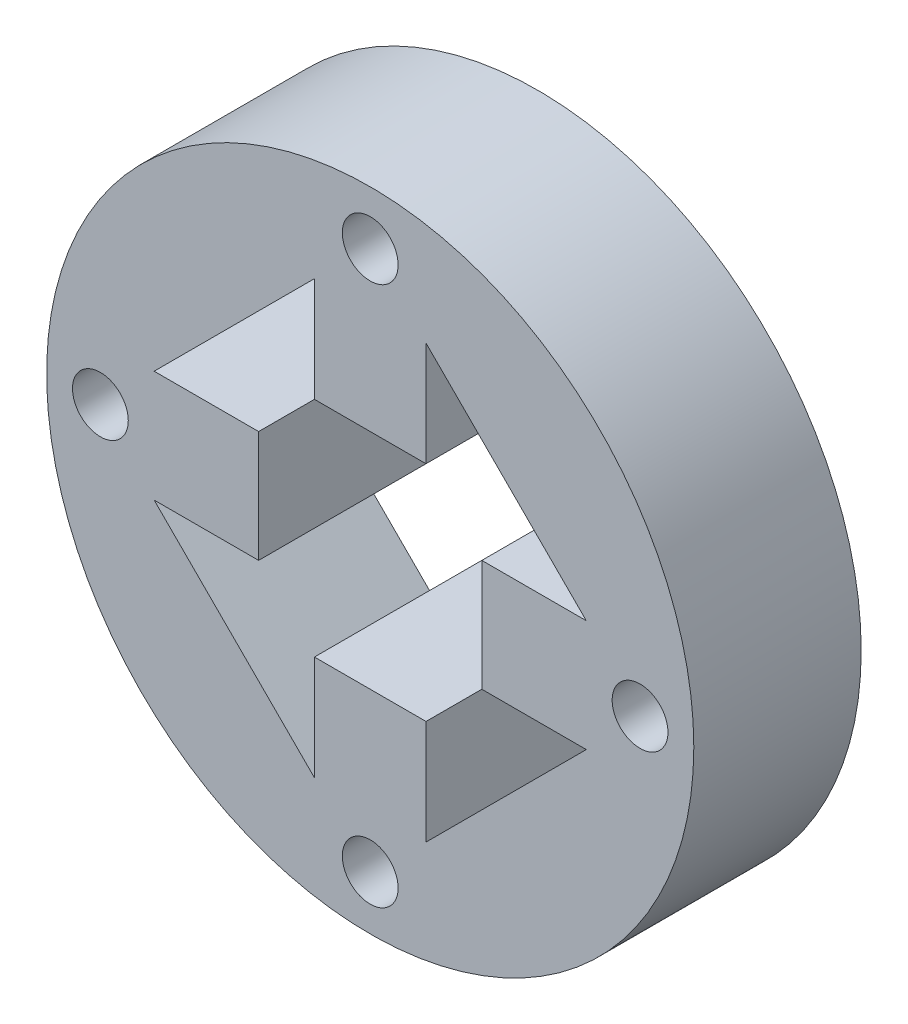
ISO-10303-21;
HEADER;
FILE_DESCRIPTION(('STEP AP214'),'2;1');
FILE_NAME('part.step','',(''),(''),'','','');
FILE_SCHEMA(('AUTOMOTIVE_DESIGN { 1 0 10303 214 1 1 1 1 }'));
ENDSEC;
DATA;
#1=APPLICATION_CONTEXT('core data for automotive mechanical design processes');
#2=APPLICATION_PROTOCOL_DEFINITION('international standard','automotive_design',2000,#1);
#3=PRODUCT_CONTEXT('',#1,'mechanical');
#4=PRODUCT('Part','Part','',(#3));
#5=PRODUCT_RELATED_PRODUCT_CATEGORY('part','',(#4));
#6=PRODUCT_DEFINITION_FORMATION('','',#4);
#7=PRODUCT_DEFINITION_CONTEXT('part definition',#1,'design');
#8=PRODUCT_DEFINITION('design','',#6,#7);
#9=PRODUCT_DEFINITION_SHAPE('','',#8);
#10=(LENGTH_UNIT() NAMED_UNIT(*) SI_UNIT(.MILLI.,.METRE.));
#11=(NAMED_UNIT(*) PLANE_ANGLE_UNIT() SI_UNIT($,.RADIAN.));
#12=(NAMED_UNIT(*) SI_UNIT($,.STERADIAN.) SOLID_ANGLE_UNIT());
#13=UNCERTAINTY_MEASURE_WITH_UNIT(LENGTH_MEASURE(1.E-05),#10,'distance_accuracy_value','');
#14=(GEOMETRIC_REPRESENTATION_CONTEXT(3) GLOBAL_UNCERTAINTY_ASSIGNED_CONTEXT((#13)) GLOBAL_UNIT_ASSIGNED_CONTEXT((#10,
#11,#12)) REPRESENTATION_CONTEXT('',''));
#15=CARTESIAN_POINT('',(0.,0.,0.));
#16=DIRECTION('',(0.,0.,1.));
#17=DIRECTION('',(1.,0.,0.));
#18=AXIS2_PLACEMENT_3D('',#15,#16,#17);
#19=CARTESIAN_POINT('',(0.,0.,-15.));
#20=DIRECTION('',(0.,0.,1.));
#21=DIRECTION('',(1.,0.,0.));
#22=AXIS2_PLACEMENT_3D('',#19,#20,#21);
#23=CYLINDRICAL_SURFACE('',#22,29.);
#24=CARTESIAN_POINT('',(0.,0.,-15.));
#25=DIRECTION('',(0.,0.,1.));
#26=DIRECTION('',(1.,0.,0.));
#27=AXIS2_PLACEMENT_3D('',#24,#25,#26);
#28=CIRCLE('',#27,29.);
#29=CARTESIAN_POINT('',(29.,0.,-15.));
#30=VERTEX_POINT('',#29);
#31=EDGE_CURVE('E11',#30,#30,#28,.T.);
#32=ORIENTED_EDGE('',*,*,#31,.T.);
#33=EDGE_LOOP('',(#32));
#34=FACE_BOUND('',#33,.T.);
#35=CARTESIAN_POINT('',(0.,0.,0.));
#36=DIRECTION('',(0.,0.,1.));
#37=DIRECTION('',(1.,0.,0.));
#38=AXIS2_PLACEMENT_3D('',#35,#36,#37);
#39=CIRCLE('',#38,29.);
#40=CARTESIAN_POINT('',(29.,0.,0.));
#41=VERTEX_POINT('',#40);
#42=EDGE_CURVE('E44',#41,#41,#39,.T.);
#43=ORIENTED_EDGE('',*,*,#42,.F.);
#44=EDGE_LOOP('',(#43));
#45=FACE_BOUND('',#44,.T.);
#46=ADVANCED_FACE('F36',(#34,#45),#23,.T.);
#47=CARTESIAN_POINT('',(0.,0.,-15.));
#48=DIRECTION('',(0.,0.,1.));
#49=DIRECTION('',(1.,0.,0.));
#50=AXIS2_PLACEMENT_3D('',#47,#48,#49);
#51=PLANE('',#50);
#52=CARTESIAN_POINT('',(0.,24.1824583655185,-15.));
#53=DIRECTION('',(0.,0.,1.));
#54=DIRECTION('',(1.,0.,0.));
#55=AXIS2_PLACEMENT_3D('',#52,#53,#54);
#56=CIRCLE('',#55,2.5);
#57=CARTESIAN_POINT('',(2.5,24.1824583655185,-15.));
#58=VERTEX_POINT('',#57);
#59=EDGE_CURVE('E205',#58,#58,#56,.F.);
#60=ORIENTED_EDGE('',*,*,#59,.F.);
#61=EDGE_LOOP('',(#60));
#62=FACE_BOUND('',#61,.T.);
#63=CARTESIAN_POINT('',(24.1824583655185,0.,-15.));
#64=DIRECTION('',(0.,0.,1.));
#65=DIRECTION('',(1.,0.,0.));
#66=AXIS2_PLACEMENT_3D('',#63,#64,#65);
#67=CIRCLE('',#66,2.5);
#68=CARTESIAN_POINT('',(26.6824583655185,0.,-15.));
#69=VERTEX_POINT('',#68);
#70=EDGE_CURVE('E202',#69,#69,#67,.F.);
#71=ORIENTED_EDGE('',*,*,#70,.F.);
#72=EDGE_LOOP('',(#71));
#73=FACE_BOUND('',#72,.T.);
#74=CARTESIAN_POINT('',(0.,-24.1824583655185,-15.));
#75=DIRECTION('',(0.,0.,1.));
#76=DIRECTION('',(1.,0.,0.));
#77=AXIS2_PLACEMENT_3D('',#74,#75,#76);
#78=CIRCLE('',#77,2.5);
#79=CARTESIAN_POINT('',(2.5,-24.1824583655185,-15.));
#80=VERTEX_POINT('',#79);
#81=EDGE_CURVE('E198',#80,#80,#78,.F.);
#82=ORIENTED_EDGE('',*,*,#81,.F.);
#83=EDGE_LOOP('',(#82));
#84=FACE_BOUND('',#83,.T.);
#85=CARTESIAN_POINT('',(-24.1824583655185,0.,-15.));
#86=DIRECTION('',(0.,0.,1.));
#87=DIRECTION('',(1.,0.,0.));
#88=AXIS2_PLACEMENT_3D('',#85,#86,#87);
#89=CIRCLE('',#88,2.5);
#90=CARTESIAN_POINT('',(-21.6824583655186,0.,-15.));
#91=VERTEX_POINT('',#90);
#92=EDGE_CURVE('E194',#91,#91,#89,.F.);
#93=ORIENTED_EDGE('',*,*,#92,.F.);
#94=EDGE_LOOP('',(#93));
#95=FACE_BOUND('',#94,.T.);
#96=DIRECTION('',(-1.,0.,0.));
#97=VECTOR('',#96,1.);
#98=CARTESIAN_POINT('',(0.,5.00000000000002,-15.));
#99=LINE('',#98,#97);
#100=CARTESIAN_POINT('',(19.3649167310371,5.,-15.));
#101=VERTEX_POINT('',#100);
#102=CARTESIAN_POINT('',(9.99999673103709,5.00000000000001,-15.));
#103=VERTEX_POINT('',#102);
#104=EDGE_CURVE('E276',#101,#103,#99,.T.);
#105=ORIENTED_EDGE('',*,*,#104,.F.);
#106=DIRECTION('',(-0.707106781186548,0.707106781186548,0.));
#107=VECTOR('',#106,1.);
#108=CARTESIAN_POINT('',(19.3649167310371,5.,-15.));
#109=LINE('',#108,#107);
#110=CARTESIAN_POINT('',(5.,19.3649167310371,-15.));
#111=VERTEX_POINT('',#110);
#112=EDGE_CURVE('E186',#101,#111,#109,.T.);
#113=ORIENTED_EDGE('',*,*,#112,.T.);
#114=DIRECTION('',(0.,-1.,0.));
#115=VECTOR('',#114,1.);
#116=CARTESIAN_POINT('',(4.99999999999994,0.,-15.));
#117=LINE('',#116,#115);
#118=CARTESIAN_POINT('',(4.99999999999997,9.99999673103708,-15.));
#119=VERTEX_POINT('',#118);
#120=EDGE_CURVE('E249',#111,#119,#117,.T.);
#121=ORIENTED_EDGE('',*,*,#120,.T.);
#122=DIRECTION('',(1.,0.,0.));
#123=VECTOR('',#122,1.);
#124=CARTESIAN_POINT('',(0.,9.99999673103708,-15.));
#125=LINE('',#124,#123);
#126=CARTESIAN_POINT('',(-5.,9.99999673103708,-15.));
#127=VERTEX_POINT('',#126);
#128=EDGE_CURVE('E255',#127,#119,#125,.T.);
#129=ORIENTED_EDGE('',*,*,#128,.F.);
#130=DIRECTION('',(0.,-1.,0.));
#131=VECTOR('',#130,1.);
#132=CARTESIAN_POINT('',(-5.,0.,-15.));
#133=LINE('',#132,#131);
#134=CARTESIAN_POINT('',(-5.,19.3649167310371,-15.));
#135=VERTEX_POINT('',#134);
#136=EDGE_CURVE('E251',#135,#127,#133,.T.);
#137=ORIENTED_EDGE('',*,*,#136,.F.);
#138=DIRECTION('',(-0.707106781186548,-0.707106781186547,0.));
#139=VECTOR('',#138,1.);
#140=CARTESIAN_POINT('',(-5.,19.3649167310371,-15.));
#141=LINE('',#140,#139);
#142=CARTESIAN_POINT('',(-19.3649167310371,5.,-15.));
#143=VERTEX_POINT('',#142);
#144=EDGE_CURVE('E182',#135,#143,#141,.T.);
#145=ORIENTED_EDGE('',*,*,#144,.T.);
#146=DIRECTION('',(1.,0.,0.));
#147=VECTOR('',#146,1.);
#148=CARTESIAN_POINT('',(0.,5.00000000000001,-15.));
#149=LINE('',#148,#147);
#150=CARTESIAN_POINT('',(-9.99999673103708,5.,-15.));
#151=VERTEX_POINT('',#150);
#152=EDGE_CURVE('E230',#143,#151,#149,.T.);
#153=ORIENTED_EDGE('',*,*,#152,.T.);
#154=DIRECTION('',(0.,-1.,0.));
#155=VECTOR('',#154,1.);
#156=CARTESIAN_POINT('',(-9.99999673103708,0.,-15.));
#157=LINE('',#156,#155);
#158=CARTESIAN_POINT('',(-9.99999673103708,-5.,-15.));
#159=VERTEX_POINT('',#158);
#160=EDGE_CURVE('E227',#151,#159,#157,.T.);
#161=ORIENTED_EDGE('',*,*,#160,.T.);
#162=DIRECTION('',(1.,0.,0.));
#163=VECTOR('',#162,1.);
#164=CARTESIAN_POINT('',(0.,-5.,-15.));
#165=LINE('',#164,#163);
#166=CARTESIAN_POINT('',(-19.3649167310371,-5.,-15.));
#167=VERTEX_POINT('',#166);
#168=EDGE_CURVE('E224',#167,#159,#165,.T.);
#169=ORIENTED_EDGE('',*,*,#168,.F.);
#170=DIRECTION('',(0.707106781186548,-0.707106781186548,0.));
#171=VECTOR('',#170,1.);
#172=CARTESIAN_POINT('',(-19.3649167310371,-5.,-15.));
#173=LINE('',#172,#171);
#174=CARTESIAN_POINT('',(-5.,-19.3649167310371,-15.));
#175=VERTEX_POINT('',#174);
#176=EDGE_CURVE('E176',#167,#175,#173,.T.);
#177=ORIENTED_EDGE('',*,*,#176,.T.);
#178=DIRECTION('',(0.,1.,0.));
#179=VECTOR('',#178,1.);
#180=CARTESIAN_POINT('',(-5.,0.,-15.));
#181=LINE('',#180,#179);
#182=CARTESIAN_POINT('',(-5.,-9.99999673103708,-15.));
#183=VERTEX_POINT('',#182);
#184=EDGE_CURVE('E208',#175,#183,#181,.T.);
#185=ORIENTED_EDGE('',*,*,#184,.T.);
#186=DIRECTION('',(1.,0.,0.));
#187=VECTOR('',#186,1.);
#188=CARTESIAN_POINT('',(0.,-9.99999673103708,-15.));
#189=LINE('',#188,#187);
#190=CARTESIAN_POINT('',(5.,-9.99999673103708,-15.));
#191=VERTEX_POINT('',#190);
#192=EDGE_CURVE('E213',#183,#191,#189,.T.);
#193=ORIENTED_EDGE('',*,*,#192,.T.);
#194=DIRECTION('',(0.,1.,0.));
#195=VECTOR('',#194,1.);
#196=CARTESIAN_POINT('',(4.99999999999999,0.,-15.));
#197=LINE('',#196,#195);
#198=CARTESIAN_POINT('',(5.,-19.3649167310371,-15.));
#199=VERTEX_POINT('',#198);
#200=EDGE_CURVE('E211',#199,#191,#197,.T.);
#201=ORIENTED_EDGE('',*,*,#200,.F.);
#202=DIRECTION('',(0.707106781186548,0.707106781186547,0.));
#203=VECTOR('',#202,1.);
#204=CARTESIAN_POINT('',(5.,-19.3649167310371,-15.));
#205=LINE('',#204,#203);
#206=CARTESIAN_POINT('',(19.3649167310371,-5.,-15.));
#207=VERTEX_POINT('',#206);
#208=EDGE_CURVE('E166',#199,#207,#205,.T.);
#209=ORIENTED_EDGE('',*,*,#208,.T.);
#210=DIRECTION('',(-1.,0.,0.));
#211=VECTOR('',#210,1.);
#212=CARTESIAN_POINT('',(0.,-5.00000000000002,-15.));
#213=LINE('',#212,#211);
#214=CARTESIAN_POINT('',(9.99999673103709,-5.00000000000001,-15.));
#215=VERTEX_POINT('',#214);
#216=EDGE_CURVE('E274',#207,#215,#213,.T.);
#217=ORIENTED_EDGE('',*,*,#216,.T.);
#218=DIRECTION('',(0.,-1.,0.));
#219=VECTOR('',#218,1.);
#220=CARTESIAN_POINT('',(9.99999673103709,0.,-15.));
#221=LINE('',#220,#219);
#222=EDGE_CURVE('E280',#103,#215,#221,.T.);
#223=ORIENTED_EDGE('',*,*,#222,.F.);
#224=EDGE_LOOP('',(#105,#113,#121,#129,#137,#145,#153,#161,#169,#177,#185,#193,#201,#209,#217,#223));
#225=FACE_BOUND('',#224,.T.);
#226=ORIENTED_EDGE('',*,*,#31,.F.);
#227=EDGE_LOOP('',(#226));
#228=FACE_BOUND('',#227,.T.);
#229=ADVANCED_FACE('F314',(#62,#73,#84,#95,#225,#228),#51,.F.);
#230=CARTESIAN_POINT('',(0.,0.,0.));
#231=DIRECTION('',(0.,0.,1.));
#232=DIRECTION('',(1.,0.,0.));
#233=AXIS2_PLACEMENT_3D('',#230,#231,#232);
#234=PLANE('',#233);
#235=CARTESIAN_POINT('',(0.,24.1824583655185,0.));
#236=DIRECTION('',(0.,0.,1.));
#237=DIRECTION('',(1.,0.,0.));
#238=AXIS2_PLACEMENT_3D('',#235,#236,#237);
#239=CIRCLE('',#238,2.5);
#240=CARTESIAN_POINT('',(2.5,24.1824583655185,0.));
#241=VERTEX_POINT('',#240);
#242=EDGE_CURVE('E39',#241,#241,#239,.F.);
#243=ORIENTED_EDGE('',*,*,#242,.T.);
#244=EDGE_LOOP('',(#243));
#245=FACE_BOUND('',#244,.T.);
#246=CARTESIAN_POINT('',(24.1824583655185,0.,0.));
#247=DIRECTION('',(0.,0.,1.));
#248=DIRECTION('',(1.,0.,0.));
#249=AXIS2_PLACEMENT_3D('',#246,#247,#248);
#250=CIRCLE('',#249,2.5);
#251=CARTESIAN_POINT('',(26.6824583655185,0.,0.));
#252=VERTEX_POINT('',#251);
#253=EDGE_CURVE('E201',#252,#252,#250,.F.);
#254=ORIENTED_EDGE('',*,*,#253,.T.);
#255=EDGE_LOOP('',(#254));
#256=FACE_BOUND('',#255,.T.);
#257=CARTESIAN_POINT('',(0.,-24.1824583655185,0.));
#258=DIRECTION('',(0.,0.,1.));
#259=DIRECTION('',(1.,0.,0.));
#260=AXIS2_PLACEMENT_3D('',#257,#258,#259);
#261=CIRCLE('',#260,2.5);
#262=CARTESIAN_POINT('',(2.5,-24.1824583655185,0.));
#263=VERTEX_POINT('',#262);
#264=EDGE_CURVE('E197',#263,#263,#261,.F.);
#265=ORIENTED_EDGE('',*,*,#264,.T.);
#266=EDGE_LOOP('',(#265));
#267=FACE_BOUND('',#266,.T.);
#268=CARTESIAN_POINT('',(-24.1824583655185,0.,0.));
#269=DIRECTION('',(0.,0.,1.));
#270=DIRECTION('',(1.,0.,0.));
#271=AXIS2_PLACEMENT_3D('',#268,#269,#270);
#272=CIRCLE('',#271,2.5);
#273=CARTESIAN_POINT('',(-21.6824583655186,0.,0.));
#274=VERTEX_POINT('',#273);
#275=EDGE_CURVE('E191',#274,#274,#272,.F.);
#276=ORIENTED_EDGE('',*,*,#275,.T.);
#277=EDGE_LOOP('',(#276));
#278=FACE_BOUND('',#277,.T.);
#279=DIRECTION('',(0.,-1.,0.));
#280=VECTOR('',#279,1.);
#281=CARTESIAN_POINT('',(4.99999999999994,0.,0.));
#282=LINE('',#281,#280);
#283=CARTESIAN_POINT('',(5.,19.3649167310371,0.));
#284=VERTEX_POINT('',#283);
#285=CARTESIAN_POINT('',(4.99999999999997,9.99999673103708,0.));
#286=VERTEX_POINT('',#285);
#287=EDGE_CURVE('E242',#284,#286,#282,.T.);
#288=ORIENTED_EDGE('',*,*,#287,.F.);
#289=DIRECTION('',(-0.707106781186548,0.707106781186548,0.));
#290=VECTOR('',#289,1.);
#291=CARTESIAN_POINT('',(19.3649167310371,5.,0.));
#292=LINE('',#291,#290);
#293=CARTESIAN_POINT('',(19.3649167310371,5.,0.));
#294=VERTEX_POINT('',#293);
#295=EDGE_CURVE('E189',#294,#284,#292,.T.);
#296=ORIENTED_EDGE('',*,*,#295,.F.);
#297=DIRECTION('',(-1.,0.,0.));
#298=VECTOR('',#297,1.);
#299=CARTESIAN_POINT('',(0.,5.00000000000002,0.));
#300=LINE('',#299,#298);
#301=CARTESIAN_POINT('',(9.99999673103709,5.00000000000001,0.));
#302=VERTEX_POINT('',#301);
#303=EDGE_CURVE('E285',#294,#302,#300,.T.);
#304=ORIENTED_EDGE('',*,*,#303,.T.);
#305=DIRECTION('',(0.,-1.,0.));
#306=VECTOR('',#305,1.);
#307=CARTESIAN_POINT('',(9.99999673103709,0.,0.));
#308=LINE('',#307,#306);
#309=CARTESIAN_POINT('',(9.99999673103709,-5.00000000000001,0.));
#310=VERTEX_POINT('',#309);
#311=EDGE_CURVE('E277',#302,#310,#308,.T.);
#312=ORIENTED_EDGE('',*,*,#311,.T.);
#313=DIRECTION('',(-1.,0.,0.));
#314=VECTOR('',#313,1.);
#315=CARTESIAN_POINT('',(0.,-5.00000000000002,0.));
#316=LINE('',#315,#314);
#317=CARTESIAN_POINT('',(19.3649167310371,-5.,0.));
#318=VERTEX_POINT('',#317);
#319=EDGE_CURVE('E175',#318,#310,#316,.T.);
#320=ORIENTED_EDGE('',*,*,#319,.F.);
#321=DIRECTION('',(0.707106781186548,0.707106781186547,0.));
#322=VECTOR('',#321,1.);
#323=CARTESIAN_POINT('',(5.,-19.3649167310371,0.));
#324=LINE('',#323,#322);
#325=CARTESIAN_POINT('',(5.,-19.3649167310371,0.));
#326=VERTEX_POINT('',#325);
#327=EDGE_CURVE('E164',#326,#318,#324,.T.);
#328=ORIENTED_EDGE('',*,*,#327,.F.);
#329=DIRECTION('',(0.,1.,0.));
#330=VECTOR('',#329,1.);
#331=CARTESIAN_POINT('',(4.99999999999999,0.,0.));
#332=LINE('',#331,#330);
#333=CARTESIAN_POINT('',(5.,-9.99999673103708,0.));
#334=VERTEX_POINT('',#333);
#335=EDGE_CURVE('E149',#326,#334,#332,.T.);
#336=ORIENTED_EDGE('',*,*,#335,.T.);
#337=DIRECTION('',(1.,0.,0.));
#338=VECTOR('',#337,1.);
#339=CARTESIAN_POINT('',(0.,-9.99999673103708,0.));
#340=LINE('',#339,#338);
#341=CARTESIAN_POINT('',(-5.,-9.99999673103708,0.));
#342=VERTEX_POINT('',#341);
#343=EDGE_CURVE('E156',#342,#334,#340,.T.);
#344=ORIENTED_EDGE('',*,*,#343,.F.);
#345=DIRECTION('',(0.,1.,0.));
#346=VECTOR('',#345,1.);
#347=CARTESIAN_POINT('',(-5.,0.,0.));
#348=LINE('',#347,#346);
#349=CARTESIAN_POINT('',(-5.,-19.3649167310371,0.));
#350=VERTEX_POINT('',#349);
#351=EDGE_CURVE('E157',#350,#342,#348,.T.);
#352=ORIENTED_EDGE('',*,*,#351,.F.);
#353=DIRECTION('',(0.707106781186548,-0.707106781186548,0.));
#354=VECTOR('',#353,1.);
#355=CARTESIAN_POINT('',(-19.3649167310371,-5.,0.));
#356=LINE('',#355,#354);
#357=CARTESIAN_POINT('',(-19.3649167310371,-5.,0.));
#358=VERTEX_POINT('',#357);
#359=EDGE_CURVE('E60',#358,#350,#356,.T.);
#360=ORIENTED_EDGE('',*,*,#359,.F.);
#361=DIRECTION('',(1.,0.,0.));
#362=VECTOR('',#361,1.);
#363=CARTESIAN_POINT('',(0.,-5.,0.));
#364=LINE('',#363,#362);
#365=CARTESIAN_POINT('',(-9.99999673103708,-5.,0.));
#366=VERTEX_POINT('',#365);
#367=EDGE_CURVE('E221',#358,#366,#364,.T.);
#368=ORIENTED_EDGE('',*,*,#367,.T.);
#369=DIRECTION('',(0.,-1.,0.));
#370=VECTOR('',#369,1.);
#371=CARTESIAN_POINT('',(-9.99999673103708,0.,0.));
#372=LINE('',#371,#370);
#373=CARTESIAN_POINT('',(-9.99999673103708,5.,0.));
#374=VERTEX_POINT('',#373);
#375=EDGE_CURVE('E235',#374,#366,#372,.T.);
#376=ORIENTED_EDGE('',*,*,#375,.F.);
#377=DIRECTION('',(1.,0.,0.));
#378=VECTOR('',#377,1.);
#379=CARTESIAN_POINT('',(0.,5.00000000000001,0.));
#380=LINE('',#379,#378);
#381=CARTESIAN_POINT('',(-19.3649167310371,5.,0.));
#382=VERTEX_POINT('',#381);
#383=EDGE_CURVE('E228',#382,#374,#380,.T.);
#384=ORIENTED_EDGE('',*,*,#383,.F.);
#385=DIRECTION('',(-0.707106781186548,-0.707106781186547,0.));
#386=VECTOR('',#385,1.);
#387=CARTESIAN_POINT('',(-5.,19.3649167310371,0.));
#388=LINE('',#387,#386);
#389=CARTESIAN_POINT('',(-5.,19.3649167310371,0.));
#390=VERTEX_POINT('',#389);
#391=EDGE_CURVE('E184',#390,#382,#388,.T.);
#392=ORIENTED_EDGE('',*,*,#391,.F.);
#393=DIRECTION('',(0.,-1.,0.));
#394=VECTOR('',#393,1.);
#395=CARTESIAN_POINT('',(-5.,0.,0.));
#396=LINE('',#395,#394);
#397=CARTESIAN_POINT('',(-5.,9.99999673103708,0.));
#398=VERTEX_POINT('',#397);
#399=EDGE_CURVE('E261',#390,#398,#396,.T.);
#400=ORIENTED_EDGE('',*,*,#399,.T.);
#401=DIRECTION('',(1.,0.,0.));
#402=VECTOR('',#401,1.);
#403=CARTESIAN_POINT('',(0.,9.99999673103708,0.));
#404=LINE('',#403,#402);
#405=EDGE_CURVE('E252',#398,#286,#404,.T.);
#406=ORIENTED_EDGE('',*,*,#405,.T.);
#407=EDGE_LOOP('',(#288,#296,#304,#312,#320,#328,#336,#344,#352,#360,#368,#376,#384,#392,#400,#406));
#408=FACE_BOUND('',#407,.T.);
#409=ORIENTED_EDGE('',*,*,#42,.T.);
#410=EDGE_LOOP('',(#409));
#411=FACE_BOUND('',#410,.T.);
#412=ADVANCED_FACE('F171',(#245,#256,#267,#278,#408,#411),#234,.T.);
#413=CARTESIAN_POINT('',(0.,-5.00000000000002,-15.));
#414=DIRECTION('',(0.,1.,0.));
#415=DIRECTION('',(-1.,0.,0.));
#416=AXIS2_PLACEMENT_3D('',#413,#414,#415);
#417=PLANE('',#416);
#418=ORIENTED_EDGE('',*,*,#319,.T.);
#419=DIRECTION('',(0.,0.,1.));
#420=VECTOR('',#419,1.);
#421=CARTESIAN_POINT('',(9.99999673103709,-5.00000000000001,-15.));
#422=LINE('',#421,#420);
#423=EDGE_CURVE('E289',#215,#310,#422,.T.);
#424=ORIENTED_EDGE('',*,*,#423,.F.);
#425=ORIENTED_EDGE('',*,*,#216,.F.);
#426=DIRECTION('',(0.,0.,1.));
#427=VECTOR('',#426,1.);
#428=CARTESIAN_POINT('',(19.3649167310371,-5.,-15.));
#429=LINE('',#428,#427);
#430=EDGE_CURVE('E283',#207,#318,#429,.T.);
#431=ORIENTED_EDGE('',*,*,#430,.T.);
#432=EDGE_LOOP('',(#418,#424,#425,#431));
#433=FACE_BOUND('',#432,.T.);
#434=ADVANCED_FACE('F332',(#433),#417,.F.);
#435=CARTESIAN_POINT('',(9.99999673103709,0.,-15.));
#436=DIRECTION('',(-1.,0.,0.));
#437=DIRECTION('',(0.,-1.,0.));
#438=AXIS2_PLACEMENT_3D('',#435,#436,#437);
#439=PLANE('',#438);
#440=ORIENTED_EDGE('',*,*,#311,.F.);
#441=DIRECTION('',(0.,0.,1.));
#442=VECTOR('',#441,1.);
#443=CARTESIAN_POINT('',(9.99999673103709,5.00000000000001,-15.));
#444=LINE('',#443,#442);
#445=EDGE_CURVE('E291',#103,#302,#444,.T.);
#446=ORIENTED_EDGE('',*,*,#445,.F.);
#447=ORIENTED_EDGE('',*,*,#222,.T.);
#448=ORIENTED_EDGE('',*,*,#423,.T.);
#449=EDGE_LOOP('',(#440,#446,#447,#448));
#450=FACE_BOUND('',#449,.T.);
#451=ADVANCED_FACE('F337',(#450),#439,.T.);
#452=CARTESIAN_POINT('',(0.,5.00000000000002,-15.));
#453=DIRECTION('',(0.,1.,0.));
#454=DIRECTION('',(-1.,0.,0.));
#455=AXIS2_PLACEMENT_3D('',#452,#453,#454);
#456=PLANE('',#455);
#457=ORIENTED_EDGE('',*,*,#303,.F.);
#458=DIRECTION('',(0.,0.,1.));
#459=VECTOR('',#458,1.);
#460=CARTESIAN_POINT('',(19.3649167310371,5.,-15.));
#461=LINE('',#460,#459);
#462=EDGE_CURVE('E293',#101,#294,#461,.T.);
#463=ORIENTED_EDGE('',*,*,#462,.F.);
#464=ORIENTED_EDGE('',*,*,#104,.T.);
#465=ORIENTED_EDGE('',*,*,#445,.T.);
#466=EDGE_LOOP('',(#457,#463,#464,#465));
#467=FACE_BOUND('',#466,.T.);
#468=ADVANCED_FACE('F342',(#467),#456,.T.);
#469=CARTESIAN_POINT('',(4.99999999999994,0.,-15.));
#470=DIRECTION('',(-1.,0.,0.));
#471=DIRECTION('',(0.,-1.,0.));
#472=AXIS2_PLACEMENT_3D('',#469,#470,#471);
#473=PLANE('',#472);
#474=ORIENTED_EDGE('',*,*,#287,.T.);
#475=DIRECTION('',(0.,0.,1.));
#476=VECTOR('',#475,1.);
#477=CARTESIAN_POINT('',(4.99999999999997,9.99999673103708,-15.));
#478=LINE('',#477,#476);
#479=EDGE_CURVE('E266',#119,#286,#478,.T.);
#480=ORIENTED_EDGE('',*,*,#479,.F.);
#481=ORIENTED_EDGE('',*,*,#120,.F.);
#482=DIRECTION('',(0.,0.,1.));
#483=VECTOR('',#482,1.);
#484=CARTESIAN_POINT('',(5.,19.3649167310371,-15.));
#485=LINE('',#484,#483);
#486=EDGE_CURVE('E258',#111,#284,#485,.T.);
#487=ORIENTED_EDGE('',*,*,#486,.T.);
#488=EDGE_LOOP('',(#474,#480,#481,#487));
#489=FACE_BOUND('',#488,.T.);
#490=ADVANCED_FACE('F345',(#489),#473,.F.);
#491=CARTESIAN_POINT('',(0.,9.99999673103708,-15.));
#492=DIRECTION('',(0.,-1.,0.));
#493=DIRECTION('',(0.,0.,-1.));
#494=AXIS2_PLACEMENT_3D('',#491,#492,#493);
#495=PLANE('',#494);
#496=ORIENTED_EDGE('',*,*,#405,.F.);
#497=DIRECTION('',(0.,0.,1.));
#498=VECTOR('',#497,1.);
#499=CARTESIAN_POINT('',(-5.,9.99999673103708,-15.));
#500=LINE('',#499,#498);
#501=EDGE_CURVE('E268',#127,#398,#500,.T.);
#502=ORIENTED_EDGE('',*,*,#501,.F.);
#503=ORIENTED_EDGE('',*,*,#128,.T.);
#504=ORIENTED_EDGE('',*,*,#479,.T.);
#505=EDGE_LOOP('',(#496,#502,#503,#504));
#506=FACE_BOUND('',#505,.T.);
#507=ADVANCED_FACE('F352',(#506),#495,.T.);
#508=CARTESIAN_POINT('',(-5.,0.,-15.));
#509=DIRECTION('',(-1.,0.,0.));
#510=DIRECTION('',(0.,-1.,0.));
#511=AXIS2_PLACEMENT_3D('',#508,#509,#510);
#512=PLANE('',#511);
#513=ORIENTED_EDGE('',*,*,#399,.F.);
#514=DIRECTION('',(0.,0.,1.));
#515=VECTOR('',#514,1.);
#516=CARTESIAN_POINT('',(-5.,19.3649167310371,-15.));
#517=LINE('',#516,#515);
#518=EDGE_CURVE('E270',#135,#390,#517,.T.);
#519=ORIENTED_EDGE('',*,*,#518,.F.);
#520=ORIENTED_EDGE('',*,*,#136,.T.);
#521=ORIENTED_EDGE('',*,*,#501,.T.);
#522=EDGE_LOOP('',(#513,#519,#520,#521));
#523=FACE_BOUND('',#522,.T.);
#524=ADVANCED_FACE('F354',(#523),#512,.T.);
#525=CARTESIAN_POINT('',(0.,5.00000000000001,-15.));
#526=DIRECTION('',(0.,-1.,0.));
#527=DIRECTION('',(1.,0.,0.));
#528=AXIS2_PLACEMENT_3D('',#525,#526,#527);
#529=PLANE('',#528);
#530=ORIENTED_EDGE('',*,*,#383,.T.);
#531=DIRECTION('',(0.,0.,1.));
#532=VECTOR('',#531,1.);
#533=CARTESIAN_POINT('',(-9.99999673103708,5.,-15.));
#534=LINE('',#533,#532);
#535=EDGE_CURVE('E243',#151,#374,#534,.T.);
#536=ORIENTED_EDGE('',*,*,#535,.F.);
#537=ORIENTED_EDGE('',*,*,#152,.F.);
#538=DIRECTION('',(0.,0.,1.));
#539=VECTOR('',#538,1.);
#540=CARTESIAN_POINT('',(-19.3649167310371,5.,-15.));
#541=LINE('',#540,#539);
#542=EDGE_CURVE('E239',#143,#382,#541,.T.);
#543=ORIENTED_EDGE('',*,*,#542,.T.);
#544=EDGE_LOOP('',(#530,#536,#537,#543));
#545=FACE_BOUND('',#544,.T.);
#546=ADVANCED_FACE('F357',(#545),#529,.F.);
#547=CARTESIAN_POINT('',(-9.99999673103708,0.,-15.));
#548=DIRECTION('',(-1.,0.,0.));
#549=DIRECTION('',(0.,-1.,0.));
#550=AXIS2_PLACEMENT_3D('',#547,#548,#549);
#551=PLANE('',#550);
#552=ORIENTED_EDGE('',*,*,#375,.T.);
#553=DIRECTION('',(0.,0.,1.));
#554=VECTOR('',#553,1.);
#555=CARTESIAN_POINT('',(-9.99999673103708,-5.,-15.));
#556=LINE('',#555,#554);
#557=EDGE_CURVE('E246',#159,#366,#556,.T.);
#558=ORIENTED_EDGE('',*,*,#557,.F.);
#559=ORIENTED_EDGE('',*,*,#160,.F.);
#560=ORIENTED_EDGE('',*,*,#535,.T.);
#561=EDGE_LOOP('',(#552,#558,#559,#560));
#562=FACE_BOUND('',#561,.T.);
#563=ADVANCED_FACE('F366',(#562),#551,.F.);
#564=CARTESIAN_POINT('',(0.,-5.,-15.));
#565=DIRECTION('',(0.,-1.,0.));
#566=DIRECTION('',(1.,0.,0.));
#567=AXIS2_PLACEMENT_3D('',#564,#565,#566);
#568=PLANE('',#567);
#569=ORIENTED_EDGE('',*,*,#367,.F.);
#570=DIRECTION('',(0.,0.,1.));
#571=VECTOR('',#570,1.);
#572=CARTESIAN_POINT('',(-19.3649167310371,-5.,-15.));
#573=LINE('',#572,#571);
#574=EDGE_CURVE('E232',#167,#358,#573,.T.);
#575=ORIENTED_EDGE('',*,*,#574,.F.);
#576=ORIENTED_EDGE('',*,*,#168,.T.);
#577=ORIENTED_EDGE('',*,*,#557,.T.);
#578=EDGE_LOOP('',(#569,#575,#576,#577));
#579=FACE_BOUND('',#578,.T.);
#580=ADVANCED_FACE('F362',(#579),#568,.T.);
#581=CARTESIAN_POINT('',(-5.,0.,-15.));
#582=DIRECTION('',(1.,0.,0.));
#583=DIRECTION('',(0.,1.,0.));
#584=AXIS2_PLACEMENT_3D('',#581,#582,#583);
#585=PLANE('',#584);
#586=ORIENTED_EDGE('',*,*,#351,.T.);
#587=DIRECTION('',(0.,0.,1.));
#588=VECTOR('',#587,1.);
#589=CARTESIAN_POINT('',(-5.,-9.99999673103708,-15.));
#590=LINE('',#589,#588);
#591=EDGE_CURVE('E218',#183,#342,#590,.T.);
#592=ORIENTED_EDGE('',*,*,#591,.F.);
#593=ORIENTED_EDGE('',*,*,#184,.F.);
#594=DIRECTION('',(0.,0.,1.));
#595=VECTOR('',#594,1.);
#596=CARTESIAN_POINT('',(-5.,-19.3649167310371,-15.));
#597=LINE('',#596,#595);
#598=EDGE_CURVE('E167',#175,#350,#597,.T.);
#599=ORIENTED_EDGE('',*,*,#598,.T.);
#600=EDGE_LOOP('',(#586,#592,#593,#599));
#601=FACE_BOUND('',#600,.T.);
#602=ADVANCED_FACE('F365',(#601),#585,.F.);
#603=CARTESIAN_POINT('',(0.,-9.99999673103708,-15.));
#604=DIRECTION('',(0.,-1.,0.));
#605=DIRECTION('',(0.,0.,-1.));
#606=AXIS2_PLACEMENT_3D('',#603,#604,#605);
#607=PLANE('',#606);
#608=ORIENTED_EDGE('',*,*,#343,.T.);
#609=DIRECTION('',(0.,0.,1.));
#610=VECTOR('',#609,1.);
#611=CARTESIAN_POINT('',(5.,-9.99999673103708,-15.));
#612=LINE('',#611,#610);
#613=EDGE_CURVE('E152',#191,#334,#612,.T.);
#614=ORIENTED_EDGE('',*,*,#613,.F.);
#615=ORIENTED_EDGE('',*,*,#192,.F.);
#616=ORIENTED_EDGE('',*,*,#591,.T.);
#617=EDGE_LOOP('',(#608,#614,#615,#616));
#618=FACE_BOUND('',#617,.T.);
#619=ADVANCED_FACE('F376',(#618),#607,.F.);
#620=CARTESIAN_POINT('',(4.99999999999999,0.,-15.));
#621=DIRECTION('',(1.,0.,0.));
#622=DIRECTION('',(0.,1.,0.));
#623=AXIS2_PLACEMENT_3D('',#620,#621,#622);
#624=PLANE('',#623);
#625=ORIENTED_EDGE('',*,*,#335,.F.);
#626=DIRECTION('',(0.,0.,1.));
#627=VECTOR('',#626,1.);
#628=CARTESIAN_POINT('',(5.,-19.3649167310371,-15.));
#629=LINE('',#628,#627);
#630=EDGE_CURVE('E52',#199,#326,#629,.T.);
#631=ORIENTED_EDGE('',*,*,#630,.F.);
#632=ORIENTED_EDGE('',*,*,#200,.T.);
#633=ORIENTED_EDGE('',*,*,#613,.T.);
#634=EDGE_LOOP('',(#625,#631,#632,#633));
#635=FACE_BOUND('',#634,.T.);
#636=ADVANCED_FACE('F150',(#635),#624,.T.);
#637=CARTESIAN_POINT('',(-24.1824583655185,0.,38.));
#638=DIRECTION('',(0.,0.,-1.));
#639=DIRECTION('',(-1.,0.,0.));
#640=AXIS2_PLACEMENT_3D('',#637,#638,#639);
#641=CYLINDRICAL_SURFACE('',#640,2.5);
#642=ORIENTED_EDGE('',*,*,#275,.F.);
#643=EDGE_LOOP('',(#642));
#644=FACE_BOUND('',#643,.T.);
#645=ORIENTED_EDGE('',*,*,#92,.T.);
#646=EDGE_LOOP('',(#645));
#647=FACE_BOUND('',#646,.T.);
#648=ADVANCED_FACE('F380',(#644,#647),#641,.F.);
#649=CARTESIAN_POINT('',(0.,-24.1824583655185,38.));
#650=DIRECTION('',(0.,0.,-1.));
#651=DIRECTION('',(-1.,0.,0.));
#652=AXIS2_PLACEMENT_3D('',#649,#650,#651);
#653=CYLINDRICAL_SURFACE('',#652,2.5);
#654=ORIENTED_EDGE('',*,*,#264,.F.);
#655=EDGE_LOOP('',(#654));
#656=FACE_BOUND('',#655,.T.);
#657=ORIENTED_EDGE('',*,*,#81,.T.);
#658=EDGE_LOOP('',(#657));
#659=FACE_BOUND('',#658,.T.);
#660=ADVANCED_FACE('F310',(#656,#659),#653,.F.);
#661=CARTESIAN_POINT('',(24.1824583655185,0.,38.));
#662=DIRECTION('',(0.,0.,-1.));
#663=DIRECTION('',(-1.,0.,0.));
#664=AXIS2_PLACEMENT_3D('',#661,#662,#663);
#665=CYLINDRICAL_SURFACE('',#664,2.5);
#666=ORIENTED_EDGE('',*,*,#253,.F.);
#667=EDGE_LOOP('',(#666));
#668=FACE_BOUND('',#667,.T.);
#669=ORIENTED_EDGE('',*,*,#70,.T.);
#670=EDGE_LOOP('',(#669));
#671=FACE_BOUND('',#670,.T.);
#672=ADVANCED_FACE('F306',(#668,#671),#665,.F.);
#673=CARTESIAN_POINT('',(0.,24.1824583655185,38.));
#674=DIRECTION('',(0.,0.,-1.));
#675=DIRECTION('',(-1.,0.,0.));
#676=AXIS2_PLACEMENT_3D('',#673,#674,#675);
#677=CYLINDRICAL_SURFACE('',#676,2.5);
#678=ORIENTED_EDGE('',*,*,#242,.F.);
#679=EDGE_LOOP('',(#678));
#680=FACE_BOUND('',#679,.T.);
#681=ORIENTED_EDGE('',*,*,#59,.T.);
#682=EDGE_LOOP('',(#681));
#683=FACE_BOUND('',#682,.T.);
#684=ADVANCED_FACE('F309',(#680,#683),#677,.F.);
#685=CARTESIAN_POINT('',(19.3649167310371,5.,0.));
#686=DIRECTION('',(-0.707106781186548,-0.707106781186548,0.));
#687=DIRECTION('',(0.707106781186548,-0.707106781186548,0.));
#688=AXIS2_PLACEMENT_3D('',#685,#686,#687);
#689=PLANE('',#688);
#690=ORIENTED_EDGE('',*,*,#112,.F.);
#691=ORIENTED_EDGE('',*,*,#462,.T.);
#692=ORIENTED_EDGE('',*,*,#295,.T.);
#693=ORIENTED_EDGE('',*,*,#486,.F.);
#694=EDGE_LOOP('',(#690,#691,#692,#693));
#695=FACE_BOUND('',#694,.T.);
#696=ADVANCED_FACE('F392',(#695),#689,.T.);
#697=CARTESIAN_POINT('',(-5.,19.3649167310371,0.));
#698=DIRECTION('',(0.707106781186547,-0.707106781186548,0.));
#699=DIRECTION('',(0.707106781186548,0.707106781186547,0.));
#700=AXIS2_PLACEMENT_3D('',#697,#698,#699);
#701=PLANE('',#700);
#702=ORIENTED_EDGE('',*,*,#144,.F.);
#703=ORIENTED_EDGE('',*,*,#518,.T.);
#704=ORIENTED_EDGE('',*,*,#391,.T.);
#705=ORIENTED_EDGE('',*,*,#542,.F.);
#706=EDGE_LOOP('',(#702,#703,#704,#705));
#707=FACE_BOUND('',#706,.T.);
#708=ADVANCED_FACE('F396',(#707),#701,.T.);
#709=CARTESIAN_POINT('',(-19.3649167310371,-5.,0.));
#710=DIRECTION('',(0.707106781186548,0.707106781186548,0.));
#711=DIRECTION('',(-0.707106781186548,0.707106781186548,0.));
#712=AXIS2_PLACEMENT_3D('',#709,#710,#711);
#713=PLANE('',#712);
#714=ORIENTED_EDGE('',*,*,#176,.F.);
#715=ORIENTED_EDGE('',*,*,#574,.T.);
#716=ORIENTED_EDGE('',*,*,#359,.T.);
#717=ORIENTED_EDGE('',*,*,#598,.F.);
#718=EDGE_LOOP('',(#714,#715,#716,#717));
#719=FACE_BOUND('',#718,.T.);
#720=ADVANCED_FACE('F400',(#719),#713,.T.);
#721=CARTESIAN_POINT('',(5.,-19.3649167310371,0.));
#722=DIRECTION('',(-0.707106781186547,0.707106781186548,0.));
#723=DIRECTION('',(-0.707106781186548,-0.707106781186547,0.));
#724=AXIS2_PLACEMENT_3D('',#721,#722,#723);
#725=PLANE('',#724);
#726=ORIENTED_EDGE('',*,*,#208,.F.);
#727=ORIENTED_EDGE('',*,*,#630,.T.);
#728=ORIENTED_EDGE('',*,*,#327,.T.);
#729=ORIENTED_EDGE('',*,*,#430,.F.);
#730=EDGE_LOOP('',(#726,#727,#728,#729));
#731=FACE_BOUND('',#730,.T.);
#732=ADVANCED_FACE('F162',(#731),#725,.T.);
#733=CLOSED_SHELL('',(#46,#229,#412,#434,#451,#468,#490,#507,#524,#546,#563,#580,#602,#619,#636,
#648,#660,#672,#684,#696,#708,#720,#732));
#734=MANIFOLD_SOLID_BREP('B2',#733);
#735=ADVANCED_BREP_SHAPE_REPRESENTATION('',(#18,#734),#14);
#736=SHAPE_DEFINITION_REPRESENTATION(#9,#735);
ENDSEC;
END-ISO-10303-21;
